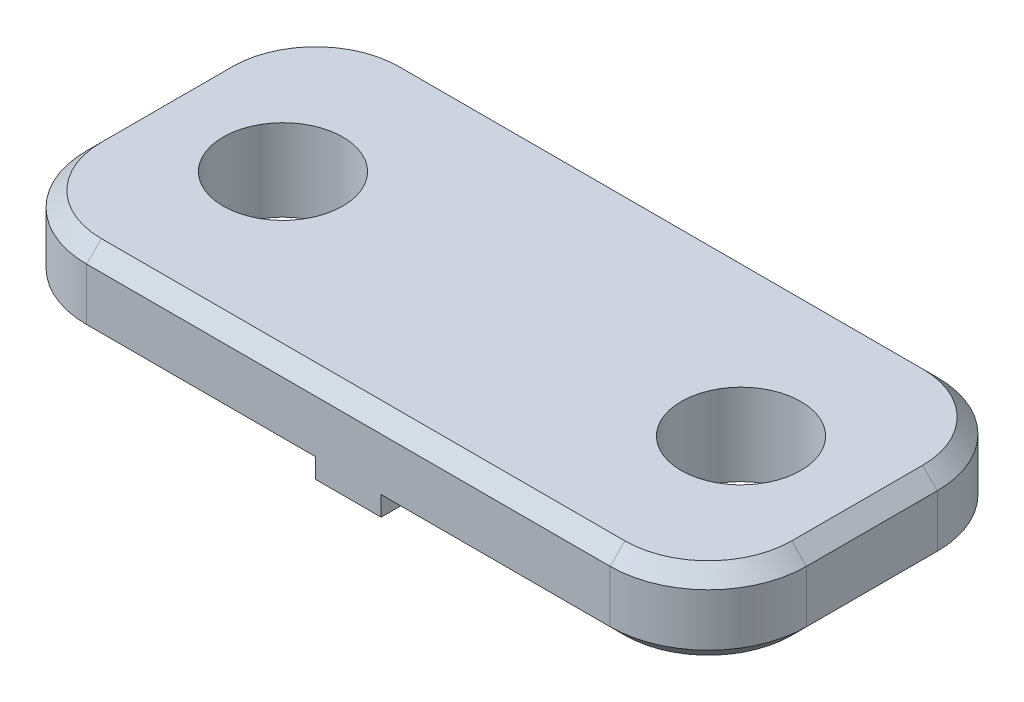
ISO-10303-21;
HEADER;
FILE_DESCRIPTION(('STEP AP214'),'2;1');
FILE_NAME('part.step','',(''),(''),'','','');
FILE_SCHEMA(('AUTOMOTIVE_DESIGN { 1 0 10303 214 1 1 1 1 }'));
ENDSEC;
DATA;
#1=APPLICATION_CONTEXT('core data for automotive mechanical design processes');
#2=APPLICATION_PROTOCOL_DEFINITION('international standard','automotive_design',2000,#1);
#3=PRODUCT_CONTEXT('',#1,'mechanical');
#4=PRODUCT('Part','Part','',(#3));
#5=PRODUCT_RELATED_PRODUCT_CATEGORY('part','',(#4));
#6=PRODUCT_DEFINITION_FORMATION('','',#4);
#7=PRODUCT_DEFINITION_CONTEXT('part definition',#1,'design');
#8=PRODUCT_DEFINITION('design','',#6,#7);
#9=PRODUCT_DEFINITION_SHAPE('','',#8);
#10=(LENGTH_UNIT() NAMED_UNIT(*) SI_UNIT(.MILLI.,.METRE.));
#11=(NAMED_UNIT(*) PLANE_ANGLE_UNIT() SI_UNIT($,.RADIAN.));
#12=(NAMED_UNIT(*) SI_UNIT($,.STERADIAN.) SOLID_ANGLE_UNIT());
#13=UNCERTAINTY_MEASURE_WITH_UNIT(LENGTH_MEASURE(1.E-05),#10,'distance_accuracy_value','');
#14=(GEOMETRIC_REPRESENTATION_CONTEXT(3) GLOBAL_UNCERTAINTY_ASSIGNED_CONTEXT((#13)) GLOBAL_UNIT_ASSIGNED_CONTEXT((#10,
#11,#12)) REPRESENTATION_CONTEXT('',''));
#15=CARTESIAN_POINT('',(0.,0.,0.));
#16=DIRECTION('',(0.,0.,1.));
#17=DIRECTION('',(1.,0.,0.));
#18=AXIS2_PLACEMENT_3D('',#15,#16,#17);
#19=CARTESIAN_POINT('',(0.,0.,0.));
#20=DIRECTION('',(0.,-1.,0.));
#21=DIRECTION('',(0.,0.,-1.));
#22=AXIS2_PLACEMENT_3D('',#19,#20,#21);
#23=PLANE('',#22);
#24=CARTESIAN_POINT('',(8.,0.,2.));
#25=DIRECTION('',(0.,-1.,0.));
#26=DIRECTION('',(0.,0.,-1.));
#27=AXIS2_PLACEMENT_3D('',#24,#25,#26);
#28=CIRCLE('',#27,2.55);
#29=CARTESIAN_POINT('',(10.55,0.,2.));
#30=VERTEX_POINT('',#29);
#31=CARTESIAN_POINT('',(8.,0.,4.55));
#32=VERTEX_POINT('',#31);
#33=EDGE_CURVE('E295',#30,#32,#28,.T.);
#34=ORIENTED_EDGE('',*,*,#33,.T.);
#35=DIRECTION('',(-1.,0.,0.));
#36=VECTOR('',#35,1.);
#37=CARTESIAN_POINT('',(1.,0.,4.55));
#38=LINE('',#37,#36);
#39=CARTESIAN_POINT('',(1.,0.,4.55));
#40=VERTEX_POINT('',#39);
#41=EDGE_CURVE('E298',#32,#40,#38,.T.);
#42=ORIENTED_EDGE('',*,*,#41,.T.);
#43=DIRECTION('',(0.,0.,1.));
#44=VECTOR('',#43,1.);
#45=CARTESIAN_POINT('',(1.,0.,5.));
#46=LINE('',#45,#44);
#47=CARTESIAN_POINT('',(1.,0.,-4.55));
#48=VERTEX_POINT('',#47);
#49=EDGE_CURVE('E408',#48,#40,#46,.T.);
#50=ORIENTED_EDGE('',*,*,#49,.F.);
#51=DIRECTION('',(1.,0.,0.));
#52=VECTOR('',#51,1.);
#53=CARTESIAN_POINT('',(8.,0.,-4.55));
#54=LINE('',#53,#52);
#55=CARTESIAN_POINT('',(8.,0.,-4.55));
#56=VERTEX_POINT('',#55);
#57=EDGE_CURVE('E286',#48,#56,#54,.T.);
#58=ORIENTED_EDGE('',*,*,#57,.T.);
#59=CARTESIAN_POINT('',(8.,0.,-2.));
#60=DIRECTION('',(0.,-1.,0.));
#61=DIRECTION('',(0.,0.,-1.));
#62=AXIS2_PLACEMENT_3D('',#59,#60,#61);
#63=CIRCLE('',#62,2.55);
#64=CARTESIAN_POINT('',(10.55,0.,-2.));
#65=VERTEX_POINT('',#64);
#66=EDGE_CURVE('E289',#56,#65,#63,.T.);
#67=ORIENTED_EDGE('',*,*,#66,.T.);
#68=DIRECTION('',(0.,0.,1.));
#69=VECTOR('',#68,1.);
#70=CARTESIAN_POINT('',(10.55,0.,2.));
#71=LINE('',#70,#69);
#72=EDGE_CURVE('E292',#65,#30,#71,.T.);
#73=ORIENTED_EDGE('',*,*,#72,.T.);
#74=EDGE_LOOP('',(#34,#42,#50,#58,#67,#73));
#75=FACE_BOUND('',#74,.T.);
#76=CARTESIAN_POINT('',(7.,0.,0.));
#77=DIRECTION('',(0.,1.,0.));
#78=DIRECTION('',(0.,0.,1.));
#79=AXIS2_PLACEMENT_3D('',#76,#77,#78);
#80=CIRCLE('',#79,1.8288);
#81=CARTESIAN_POINT('',(7.,0.,1.8288));
#82=VERTEX_POINT('',#81);
#83=EDGE_CURVE('E228',#82,#82,#80,.T.);
#84=ORIENTED_EDGE('',*,*,#83,.T.);
#85=EDGE_LOOP('',(#84));
#86=FACE_BOUND('',#85,.T.);
#87=ADVANCED_FACE('F41',(#75,#86),#23,.T.);
#88=CARTESIAN_POINT('',(11.,2.5,5.));
#89=DIRECTION('',(-1.,0.,0.));
#90=DIRECTION('',(0.,0.,1.));
#91=AXIS2_PLACEMENT_3D('',#88,#89,#90);
#92=PLANE('',#91);
#93=DIRECTION('',(0.,-1.,0.));
#94=VECTOR('',#93,1.);
#95=CARTESIAN_POINT('',(11.,2.5,2.));
#96=LINE('',#95,#94);
#97=CARTESIAN_POINT('',(11.,2.05,2.));
#98=VERTEX_POINT('',#97);
#99=CARTESIAN_POINT('',(11.,0.449999999999996,2.));
#100=VERTEX_POINT('',#99);
#101=EDGE_CURVE('E249',#98,#100,#96,.T.);
#102=ORIENTED_EDGE('',*,*,#101,.T.);
#103=DIRECTION('',(0.,0.,-1.));
#104=VECTOR('',#103,1.);
#105=CARTESIAN_POINT('',(11.,0.449999999999996,-2.));
#106=LINE('',#105,#104);
#107=CARTESIAN_POINT('',(11.,0.449999999999996,-2.));
#108=VERTEX_POINT('',#107);
#109=EDGE_CURVE('E310',#100,#108,#106,.T.);
#110=ORIENTED_EDGE('',*,*,#109,.T.);
#111=DIRECTION('',(0.,-1.,0.));
#112=VECTOR('',#111,1.);
#113=CARTESIAN_POINT('',(11.,2.5,-2.));
#114=LINE('',#113,#112);
#115=CARTESIAN_POINT('',(11.,2.05,-2.));
#116=VERTEX_POINT('',#115);
#117=EDGE_CURVE('E245',#108,#116,#114,.F.);
#118=ORIENTED_EDGE('',*,*,#117,.T.);
#119=DIRECTION('',(0.,0.,1.));
#120=VECTOR('',#119,1.);
#121=CARTESIAN_POINT('',(11.,2.05,5.));
#122=LINE('',#121,#120);
#123=EDGE_CURVE('E307',#116,#98,#122,.T.);
#124=ORIENTED_EDGE('',*,*,#123,.T.);
#125=EDGE_LOOP('',(#102,#110,#118,#124));
#126=FACE_BOUND('',#125,.T.);
#127=ADVANCED_FACE('F479',(#126),#92,.F.);
#128=CARTESIAN_POINT('',(-11.,2.5,-5.));
#129=DIRECTION('',(0.,0.,1.));
#130=DIRECTION('',(1.,0.,0.));
#131=AXIS2_PLACEMENT_3D('',#128,#129,#130);
#132=PLANE('',#131);
#133=DIRECTION('',(0.,-1.,0.));
#134=VECTOR('',#133,1.);
#135=CARTESIAN_POINT('',(8.,2.5,-5.));
#136=LINE('',#135,#134);
#137=CARTESIAN_POINT('',(8.,2.05,-5.));
#138=VERTEX_POINT('',#137);
#139=CARTESIAN_POINT('',(8.,0.449999999999996,-5.));
#140=VERTEX_POINT('',#139);
#141=EDGE_CURVE('E265',#138,#140,#136,.T.);
#142=ORIENTED_EDGE('',*,*,#141,.T.);
#143=DIRECTION('',(-1.,0.,0.));
#144=VECTOR('',#143,1.);
#145=CARTESIAN_POINT('',(1.,0.449999999999996,-5.));
#146=LINE('',#145,#144);
#147=CARTESIAN_POINT('',(1.,0.449999999999996,-5.));
#148=VERTEX_POINT('',#147);
#149=EDGE_CURVE('E325',#140,#148,#146,.T.);
#150=ORIENTED_EDGE('',*,*,#149,.T.);
#151=DIRECTION('',(0.,1.,0.));
#152=VECTOR('',#151,1.);
#153=CARTESIAN_POINT('',(1.,-0.15,-5.));
#154=LINE('',#153,#152);
#155=CARTESIAN_POINT('',(1.,-0.15,-5.));
#156=VERTEX_POINT('',#155);
#157=EDGE_CURVE('E503',#156,#148,#154,.T.);
#158=ORIENTED_EDGE('',*,*,#157,.F.);
#159=DIRECTION('',(1.,0.,0.));
#160=VECTOR('',#159,1.);
#161=CARTESIAN_POINT('',(-1.,-0.15,-5.));
#162=LINE('',#161,#160);
#163=CARTESIAN_POINT('',(-1.,-0.15,-5.));
#164=VERTEX_POINT('',#163);
#165=EDGE_CURVE('E211',#164,#156,#162,.T.);
#166=ORIENTED_EDGE('',*,*,#165,.F.);
#167=DIRECTION('',(0.,1.,0.));
#168=VECTOR('',#167,1.);
#169=CARTESIAN_POINT('',(-1.,-0.15,-5.));
#170=LINE('',#169,#168);
#171=CARTESIAN_POINT('',(-1.,0.45,-5.));
#172=VERTEX_POINT('',#171);
#173=EDGE_CURVE('E230',#164,#172,#170,.T.);
#174=ORIENTED_EDGE('',*,*,#173,.T.);
#175=DIRECTION('',(-1.,0.,0.));
#176=VECTOR('',#175,1.);
#177=CARTESIAN_POINT('',(-8.,0.45,-5.));
#178=LINE('',#177,#176);
#179=CARTESIAN_POINT('',(-8.,0.45,-5.));
#180=VERTEX_POINT('',#179);
#181=EDGE_CURVE('E322',#172,#180,#178,.T.);
#182=ORIENTED_EDGE('',*,*,#181,.T.);
#183=DIRECTION('',(0.,-1.,0.));
#184=VECTOR('',#183,1.);
#185=CARTESIAN_POINT('',(-8.,2.5,-5.));
#186=LINE('',#185,#184);
#187=CARTESIAN_POINT('',(-8.,2.05,-5.));
#188=VERTEX_POINT('',#187);
#189=EDGE_CURVE('E261',#180,#188,#186,.F.);
#190=ORIENTED_EDGE('',*,*,#189,.T.);
#191=DIRECTION('',(1.,0.,0.));
#192=VECTOR('',#191,1.);
#193=CARTESIAN_POINT('',(-11.,2.05,-5.));
#194=LINE('',#193,#192);
#195=EDGE_CURVE('E319',#188,#138,#194,.T.);
#196=ORIENTED_EDGE('',*,*,#195,.T.);
#197=EDGE_LOOP('',(#142,#150,#158,#166,#174,#182,#190,#196));
#198=FACE_BOUND('',#197,.T.);
#199=ADVANCED_FACE('F496',(#198),#132,.F.);
#200=CARTESIAN_POINT('',(-11.,2.5,5.));
#201=DIRECTION('',(1.,0.,0.));
#202=DIRECTION('',(0.,0.,-1.));
#203=AXIS2_PLACEMENT_3D('',#200,#201,#202);
#204=PLANE('',#203);
#205=DIRECTION('',(0.,-1.,0.));
#206=VECTOR('',#205,1.);
#207=CARTESIAN_POINT('',(-11.,2.5,-2.));
#208=LINE('',#207,#206);
#209=CARTESIAN_POINT('',(-11.,2.05,-2.));
#210=VERTEX_POINT('',#209);
#211=CARTESIAN_POINT('',(-11.,0.45,-2.));
#212=VERTEX_POINT('',#211);
#213=EDGE_CURVE('E273',#210,#212,#208,.T.);
#214=ORIENTED_EDGE('',*,*,#213,.T.);
#215=DIRECTION('',(0.,0.,1.));
#216=VECTOR('',#215,1.);
#217=CARTESIAN_POINT('',(-11.,0.45,2.));
#218=LINE('',#217,#216);
#219=CARTESIAN_POINT('',(-11.,0.45,2.));
#220=VERTEX_POINT('',#219);
#221=EDGE_CURVE('E354',#212,#220,#218,.T.);
#222=ORIENTED_EDGE('',*,*,#221,.T.);
#223=DIRECTION('',(0.,-1.,0.));
#224=VECTOR('',#223,1.);
#225=CARTESIAN_POINT('',(-11.,2.5,2.));
#226=LINE('',#225,#224);
#227=CARTESIAN_POINT('',(-11.,2.05,2.));
#228=VERTEX_POINT('',#227);
#229=EDGE_CURVE('E269',#220,#228,#226,.F.);
#230=ORIENTED_EDGE('',*,*,#229,.T.);
#231=DIRECTION('',(0.,0.,-1.));
#232=VECTOR('',#231,1.);
#233=CARTESIAN_POINT('',(-11.,2.05,5.));
#234=LINE('',#233,#232);
#235=EDGE_CURVE('E351',#228,#210,#234,.T.);
#236=ORIENTED_EDGE('',*,*,#235,.T.);
#237=EDGE_LOOP('',(#214,#222,#230,#236));
#238=FACE_BOUND('',#237,.T.);
#239=ADVANCED_FACE('F538',(#238),#204,.F.);
#240=CARTESIAN_POINT('',(-11.,2.5,5.));
#241=DIRECTION('',(0.,0.,-1.));
#242=DIRECTION('',(-1.,0.,0.));
#243=AXIS2_PLACEMENT_3D('',#240,#241,#242);
#244=PLANE('',#243);
#245=DIRECTION('',(0.,1.,0.));
#246=VECTOR('',#245,1.);
#247=CARTESIAN_POINT('',(1.,-0.15,5.));
#248=LINE('',#247,#246);
#249=CARTESIAN_POINT('',(1.,-0.15,5.));
#250=VERTEX_POINT('',#249);
#251=CARTESIAN_POINT('',(1.,0.449999999999996,5.));
#252=VERTEX_POINT('',#251);
#253=EDGE_CURVE('E198',#250,#252,#248,.T.);
#254=ORIENTED_EDGE('',*,*,#253,.T.);
#255=DIRECTION('',(1.,0.,0.));
#256=VECTOR('',#255,1.);
#257=CARTESIAN_POINT('',(8.,0.449999999999996,5.));
#258=LINE('',#257,#256);
#259=CARTESIAN_POINT('',(8.,0.449999999999996,5.));
#260=VERTEX_POINT('',#259);
#261=EDGE_CURVE('E283',#252,#260,#258,.T.);
#262=ORIENTED_EDGE('',*,*,#261,.T.);
#263=DIRECTION('',(0.,-1.,0.));
#264=VECTOR('',#263,1.);
#265=CARTESIAN_POINT('',(8.,2.5,5.));
#266=LINE('',#265,#264);
#267=CARTESIAN_POINT('',(8.,2.05,5.));
#268=VERTEX_POINT('',#267);
#269=EDGE_CURVE('E257',#260,#268,#266,.F.);
#270=ORIENTED_EDGE('',*,*,#269,.T.);
#271=DIRECTION('',(-1.,0.,0.));
#272=VECTOR('',#271,1.);
#273=CARTESIAN_POINT('',(-11.,2.05,5.));
#274=LINE('',#273,#272);
#275=CARTESIAN_POINT('',(-8.,2.05,5.));
#276=VERTEX_POINT('',#275);
#277=EDGE_CURVE('E277',#268,#276,#274,.T.);
#278=ORIENTED_EDGE('',*,*,#277,.T.);
#279=DIRECTION('',(0.,-1.,0.));
#280=VECTOR('',#279,1.);
#281=CARTESIAN_POINT('',(-8.,2.5,5.));
#282=LINE('',#281,#280);
#283=CARTESIAN_POINT('',(-8.,0.45,5.));
#284=VERTEX_POINT('',#283);
#285=EDGE_CURVE('E253',#276,#284,#282,.T.);
#286=ORIENTED_EDGE('',*,*,#285,.T.);
#287=DIRECTION('',(1.,0.,0.));
#288=VECTOR('',#287,1.);
#289=CARTESIAN_POINT('',(-1.,0.45,5.));
#290=LINE('',#289,#288);
#291=CARTESIAN_POINT('',(-1.,0.45,5.));
#292=VERTEX_POINT('',#291);
#293=EDGE_CURVE('E280',#284,#292,#290,.T.);
#294=ORIENTED_EDGE('',*,*,#293,.T.);
#295=DIRECTION('',(0.,1.,0.));
#296=VECTOR('',#295,1.);
#297=CARTESIAN_POINT('',(-1.,-0.15,5.));
#298=LINE('',#297,#296);
#299=CARTESIAN_POINT('',(-1.,-0.15,5.));
#300=VERTEX_POINT('',#299);
#301=EDGE_CURVE('E201',#300,#292,#298,.T.);
#302=ORIENTED_EDGE('',*,*,#301,.F.);
#303=DIRECTION('',(-1.,0.,0.));
#304=VECTOR('',#303,1.);
#305=CARTESIAN_POINT('',(-1.,-0.15,5.));
#306=LINE('',#305,#304);
#307=EDGE_CURVE('E193',#250,#300,#306,.T.);
#308=ORIENTED_EDGE('',*,*,#307,.F.);
#309=EDGE_LOOP('',(#254,#262,#270,#278,#286,#294,#302,#308));
#310=FACE_BOUND('',#309,.T.);
#311=ADVANCED_FACE('F195',(#310),#244,.F.);
#312=CARTESIAN_POINT('',(0.,2.5,0.));
#313=DIRECTION('',(0.,-1.,0.));
#314=DIRECTION('',(0.,0.,-1.));
#315=AXIS2_PLACEMENT_3D('',#312,#313,#314);
#316=PLANE('',#315);
#317=DIRECTION('',(-1.,0.,0.));
#318=VECTOR('',#317,1.);
#319=CARTESIAN_POINT('',(0.,2.5,-4.55));
#320=LINE('',#319,#318);
#321=CARTESIAN_POINT('',(8.,2.5,-4.55));
#322=VERTEX_POINT('',#321);
#323=CARTESIAN_POINT('',(-8.,2.5,-4.55));
#324=VERTEX_POINT('',#323);
#325=EDGE_CURVE('E60',#322,#324,#320,.T.);
#326=ORIENTED_EDGE('',*,*,#325,.T.);
#327=CARTESIAN_POINT('',(-8.,2.5,-2.));
#328=DIRECTION('',(0.,-1.,0.));
#329=DIRECTION('',(0.,0.,-1.));
#330=AXIS2_PLACEMENT_3D('',#327,#328,#329);
#331=CIRCLE('',#330,2.55);
#332=CARTESIAN_POINT('',(-10.55,2.5,-2.));
#333=VERTEX_POINT('',#332);
#334=EDGE_CURVE('E382',#324,#333,#331,.F.);
#335=ORIENTED_EDGE('',*,*,#334,.T.);
#336=DIRECTION('',(0.,0.,1.));
#337=VECTOR('',#336,1.);
#338=CARTESIAN_POINT('',(-10.55,2.5,0.));
#339=LINE('',#338,#337);
#340=CARTESIAN_POINT('',(-10.55,2.5,2.));
#341=VERTEX_POINT('',#340);
#342=EDGE_CURVE('E363',#333,#341,#339,.T.);
#343=ORIENTED_EDGE('',*,*,#342,.T.);
#344=CARTESIAN_POINT('',(-8.,2.5,2.));
#345=DIRECTION('',(0.,-1.,0.));
#346=DIRECTION('',(0.,0.,-1.));
#347=AXIS2_PLACEMENT_3D('',#344,#345,#346);
#348=CIRCLE('',#347,2.55);
#349=CARTESIAN_POINT('',(-8.,2.5,4.55));
#350=VERTEX_POINT('',#349);
#351=EDGE_CURVE('E366',#341,#350,#348,.F.);
#352=ORIENTED_EDGE('',*,*,#351,.T.);
#353=DIRECTION('',(1.,0.,0.));
#354=VECTOR('',#353,1.);
#355=CARTESIAN_POINT('',(0.,2.5,4.55));
#356=LINE('',#355,#354);
#357=CARTESIAN_POINT('',(8.,2.5,4.55));
#358=VERTEX_POINT('',#357);
#359=EDGE_CURVE('E369',#350,#358,#356,.T.);
#360=ORIENTED_EDGE('',*,*,#359,.T.);
#361=CARTESIAN_POINT('',(8.,2.5,2.));
#362=DIRECTION('',(0.,-1.,0.));
#363=DIRECTION('',(0.,0.,-1.));
#364=AXIS2_PLACEMENT_3D('',#361,#362,#363);
#365=CIRCLE('',#364,2.55);
#366=CARTESIAN_POINT('',(10.55,2.5,2.));
#367=VERTEX_POINT('',#366);
#368=EDGE_CURVE('E372',#358,#367,#365,.F.);
#369=ORIENTED_EDGE('',*,*,#368,.T.);
#370=DIRECTION('',(0.,0.,-1.));
#371=VECTOR('',#370,1.);
#372=CARTESIAN_POINT('',(10.55,2.5,0.));
#373=LINE('',#372,#371);
#374=CARTESIAN_POINT('',(10.55,2.5,-2.));
#375=VERTEX_POINT('',#374);
#376=EDGE_CURVE('E375',#367,#375,#373,.T.);
#377=ORIENTED_EDGE('',*,*,#376,.T.);
#378=CARTESIAN_POINT('',(8.,2.5,-2.));
#379=DIRECTION('',(0.,-1.,0.));
#380=DIRECTION('',(0.,0.,-1.));
#381=AXIS2_PLACEMENT_3D('',#378,#379,#380);
#382=CIRCLE('',#381,2.55);
#383=EDGE_CURVE('E65',#375,#322,#382,.F.);
#384=ORIENTED_EDGE('',*,*,#383,.T.);
#385=EDGE_LOOP('',(#326,#335,#343,#352,#360,#369,#377,#384));
#386=FACE_BOUND('',#385,.T.);
#387=CARTESIAN_POINT('',(7.,2.5,0.));
#388=DIRECTION('',(0.,1.,0.));
#389=DIRECTION('',(0.,0.,1.));
#390=AXIS2_PLACEMENT_3D('',#387,#388,#389);
#391=CIRCLE('',#390,1.82879999999999);
#392=CARTESIAN_POINT('',(7.,2.5,1.82879999999999));
#393=VERTEX_POINT('',#392);
#394=EDGE_CURVE('E223',#393,#393,#391,.T.);
#395=ORIENTED_EDGE('',*,*,#394,.F.);
#396=EDGE_LOOP('',(#395));
#397=FACE_BOUND('',#396,.T.);
#398=CARTESIAN_POINT('',(-7.,2.5,0.));
#399=DIRECTION('',(0.,1.,0.));
#400=DIRECTION('',(0.,0.,1.));
#401=AXIS2_PLACEMENT_3D('',#398,#399,#400);
#402=CIRCLE('',#401,1.82879999999999);
#403=CARTESIAN_POINT('',(-7.,2.5,1.82879999999999));
#404=VERTEX_POINT('',#403);
#405=EDGE_CURVE('E237',#404,#404,#402,.T.);
#406=ORIENTED_EDGE('',*,*,#405,.F.);
#407=EDGE_LOOP('',(#406));
#408=FACE_BOUND('',#407,.T.);
#409=ADVANCED_FACE('F576',(#386,#397,#408),#316,.F.);
#410=DIRECTION('',(0.,0.,-1.));
#411=VECTOR('',#410,1.);
#412=CARTESIAN_POINT('',(-1.,0.,5.));
#413=LINE('',#412,#411);
#414=CARTESIAN_POINT('',(-1.,0.,4.55));
#415=VERTEX_POINT('',#414);
#416=CARTESIAN_POINT('',(-1.,0.,-4.55));
#417=VERTEX_POINT('',#416);
#418=EDGE_CURVE('E215',#415,#417,#413,.T.);
#419=ORIENTED_EDGE('',*,*,#418,.F.);
#420=DIRECTION('',(-1.,0.,0.));
#421=VECTOR('',#420,1.);
#422=CARTESIAN_POINT('',(-8.,0.,4.55));
#423=LINE('',#422,#421);
#424=CARTESIAN_POINT('',(-8.,0.,4.55));
#425=VERTEX_POINT('',#424);
#426=EDGE_CURVE('E341',#415,#425,#423,.T.);
#427=ORIENTED_EDGE('',*,*,#426,.T.);
#428=CARTESIAN_POINT('',(-8.,0.,2.));
#429=DIRECTION('',(0.,-1.,0.));
#430=DIRECTION('',(0.,0.,-1.));
#431=AXIS2_PLACEMENT_3D('',#428,#429,#430);
#432=CIRCLE('',#431,2.55);
#433=CARTESIAN_POINT('',(-10.55,0.,2.));
#434=VERTEX_POINT('',#433);
#435=EDGE_CURVE('E329',#425,#434,#432,.T.);
#436=ORIENTED_EDGE('',*,*,#435,.T.);
#437=DIRECTION('',(0.,0.,-1.));
#438=VECTOR('',#437,1.);
#439=CARTESIAN_POINT('',(-10.55,0.,-2.));
#440=LINE('',#439,#438);
#441=CARTESIAN_POINT('',(-10.55,0.,-2.));
#442=VERTEX_POINT('',#441);
#443=EDGE_CURVE('E332',#434,#442,#440,.T.);
#444=ORIENTED_EDGE('',*,*,#443,.T.);
#445=CARTESIAN_POINT('',(-8.,0.,-2.));
#446=DIRECTION('',(0.,-1.,0.));
#447=DIRECTION('',(0.,0.,-1.));
#448=AXIS2_PLACEMENT_3D('',#445,#446,#447);
#449=CIRCLE('',#448,2.55);
#450=CARTESIAN_POINT('',(-8.,0.,-4.55));
#451=VERTEX_POINT('',#450);
#452=EDGE_CURVE('E335',#442,#451,#449,.T.);
#453=ORIENTED_EDGE('',*,*,#452,.T.);
#454=DIRECTION('',(1.,0.,0.));
#455=VECTOR('',#454,1.);
#456=CARTESIAN_POINT('',(-1.,0.,-4.55));
#457=LINE('',#456,#455);
#458=EDGE_CURVE('E338',#451,#417,#457,.T.);
#459=ORIENTED_EDGE('',*,*,#458,.T.);
#460=EDGE_LOOP('',(#419,#427,#436,#444,#453,#459));
#461=FACE_BOUND('',#460,.T.);
#462=CARTESIAN_POINT('',(-7.,0.,0.));
#463=DIRECTION('',(0.,1.,0.));
#464=DIRECTION('',(0.,0.,1.));
#465=AXIS2_PLACEMENT_3D('',#462,#463,#464);
#466=CIRCLE('',#465,1.8288);
#467=CARTESIAN_POINT('',(-7.,0.,1.8288));
#468=VERTEX_POINT('',#467);
#469=EDGE_CURVE('E241',#468,#468,#466,.T.);
#470=ORIENTED_EDGE('',*,*,#469,.T.);
#471=EDGE_LOOP('',(#470));
#472=FACE_BOUND('',#471,.T.);
#473=ADVANCED_FACE('F567',(#461,#472),#23,.T.);
#474=CARTESIAN_POINT('',(-7.,2.5,0.));
#475=DIRECTION('',(0.,1.,0.));
#476=DIRECTION('',(0.,0.,1.));
#477=AXIS2_PLACEMENT_3D('',#474,#475,#476);
#478=CYLINDRICAL_SURFACE('',#477,1.82879999999999);
#479=ORIENTED_EDGE('',*,*,#469,.F.);
#480=EDGE_LOOP('',(#479));
#481=FACE_BOUND('',#480,.T.);
#482=ORIENTED_EDGE('',*,*,#405,.T.);
#483=EDGE_LOOP('',(#482));
#484=FACE_BOUND('',#483,.T.);
#485=ADVANCED_FACE('F575',(#481,#484),#478,.F.);
#486=CARTESIAN_POINT('',(7.,2.5,0.));
#487=DIRECTION('',(0.,1.,0.));
#488=DIRECTION('',(0.,0.,1.));
#489=AXIS2_PLACEMENT_3D('',#486,#487,#488);
#490=CYLINDRICAL_SURFACE('',#489,1.82879999999999);
#491=ORIENTED_EDGE('',*,*,#83,.F.);
#492=EDGE_LOOP('',(#491));
#493=FACE_BOUND('',#492,.T.);
#494=ORIENTED_EDGE('',*,*,#394,.T.);
#495=EDGE_LOOP('',(#494));
#496=FACE_BOUND('',#495,.T.);
#497=ADVANCED_FACE('F582',(#493,#496),#490,.F.);
#498=CARTESIAN_POINT('',(1.,-0.15,5.));
#499=DIRECTION('',(-1.,0.,0.));
#500=DIRECTION('',(0.,0.,1.));
#501=AXIS2_PLACEMENT_3D('',#498,#499,#500);
#502=PLANE('',#501);
#503=ORIENTED_EDGE('',*,*,#157,.T.);
#504=DIRECTION('',(0.,-0.707106781186545,0.70710678118655));
#505=VECTOR('',#504,1.);
#506=CARTESIAN_POINT('',(1.,-4.85,0.300000000000037));
#507=LINE('',#506,#505);
#508=EDGE_CURVE('E387',#148,#48,#507,.T.);
#509=ORIENTED_EDGE('',*,*,#508,.T.);
#510=ORIENTED_EDGE('',*,*,#49,.T.);
#511=DIRECTION('',(0.,0.707106781186545,0.70710678118655));
#512=VECTOR('',#511,1.);
#513=CARTESIAN_POINT('',(1.,0.15,4.7));
#514=LINE('',#513,#512);
#515=EDGE_CURVE('E220',#40,#252,#514,.T.);
#516=ORIENTED_EDGE('',*,*,#515,.T.);
#517=ORIENTED_EDGE('',*,*,#253,.F.);
#518=DIRECTION('',(0.,0.,1.));
#519=VECTOR('',#518,1.);
#520=CARTESIAN_POINT('',(1.,-0.15,5.));
#521=LINE('',#520,#519);
#522=EDGE_CURVE('E206',#156,#250,#521,.T.);
#523=ORIENTED_EDGE('',*,*,#522,.F.);
#524=EDGE_LOOP('',(#503,#509,#510,#516,#517,#523));
#525=FACE_BOUND('',#524,.T.);
#526=ADVANCED_FACE('F217',(#525),#502,.F.);
#527=CARTESIAN_POINT('',(-1.,-0.15,5.));
#528=DIRECTION('',(1.,0.,0.));
#529=DIRECTION('',(0.,0.,-1.));
#530=AXIS2_PLACEMENT_3D('',#527,#528,#529);
#531=PLANE('',#530);
#532=ORIENTED_EDGE('',*,*,#301,.T.);
#533=DIRECTION('',(0.,-0.707106781186549,-0.707106781186547));
#534=VECTOR('',#533,1.);
#535=CARTESIAN_POINT('',(-1.,0.149999999999999,4.7));
#536=LINE('',#535,#534);
#537=EDGE_CURVE('E52',#292,#415,#536,.T.);
#538=ORIENTED_EDGE('',*,*,#537,.T.);
#539=ORIENTED_EDGE('',*,*,#418,.T.);
#540=DIRECTION('',(0.,0.707106781186549,-0.707106781186547));
#541=VECTOR('',#540,1.);
#542=CARTESIAN_POINT('',(-1.,-4.85,0.299999999999986));
#543=LINE('',#542,#541);
#544=EDGE_CURVE('E11',#417,#172,#543,.T.);
#545=ORIENTED_EDGE('',*,*,#544,.T.);
#546=ORIENTED_EDGE('',*,*,#173,.F.);
#547=DIRECTION('',(0.,0.,-1.));
#548=VECTOR('',#547,1.);
#549=CARTESIAN_POINT('',(-1.,-0.15,5.));
#550=LINE('',#549,#548);
#551=EDGE_CURVE('E205',#300,#164,#550,.T.);
#552=ORIENTED_EDGE('',*,*,#551,.F.);
#553=EDGE_LOOP('',(#532,#538,#539,#545,#546,#552));
#554=FACE_BOUND('',#553,.T.);
#555=ADVANCED_FACE('F521',(#554),#531,.F.);
#556=CARTESIAN_POINT('',(0.,-0.15,0.));
#557=DIRECTION('',(0.,-1.,0.));
#558=DIRECTION('',(0.,0.,-1.));
#559=AXIS2_PLACEMENT_3D('',#556,#557,#558);
#560=PLANE('',#559);
#561=ORIENTED_EDGE('',*,*,#522,.T.);
#562=ORIENTED_EDGE('',*,*,#307,.T.);
#563=ORIENTED_EDGE('',*,*,#551,.T.);
#564=ORIENTED_EDGE('',*,*,#165,.T.);
#565=EDGE_LOOP('',(#561,#562,#563,#564));
#566=FACE_BOUND('',#565,.T.);
#567=ADVANCED_FACE('F209',(#566),#560,.T.);
#568=CARTESIAN_POINT('',(8.,2.5,2.));
#569=DIRECTION('',(0.,-1.,0.));
#570=DIRECTION('',(0.,0.,-1.));
#571=AXIS2_PLACEMENT_3D('',#568,#569,#570);
#572=CYLINDRICAL_SURFACE('',#571,3.);
#573=ORIENTED_EDGE('',*,*,#269,.F.);
#574=CARTESIAN_POINT('',(8.,0.449999999999996,2.));
#575=DIRECTION('',(0.,-1.,0.));
#576=DIRECTION('',(0.,0.,-1.));
#577=AXIS2_PLACEMENT_3D('',#574,#575,#576);
#578=CIRCLE('',#577,3.);
#579=EDGE_CURVE('E304',#260,#100,#578,.F.);
#580=ORIENTED_EDGE('',*,*,#579,.T.);
#581=ORIENTED_EDGE('',*,*,#101,.F.);
#582=CARTESIAN_POINT('',(8.,2.05,2.));
#583=DIRECTION('',(0.,-1.,0.));
#584=DIRECTION('',(0.,0.,-1.));
#585=AXIS2_PLACEMENT_3D('',#582,#583,#584);
#586=CIRCLE('',#585,3.);
#587=EDGE_CURVE('E301',#98,#268,#586,.T.);
#588=ORIENTED_EDGE('',*,*,#587,.T.);
#589=EDGE_LOOP('',(#573,#580,#581,#588));
#590=FACE_BOUND('',#589,.T.);
#591=ADVANCED_FACE('F466',(#590),#572,.T.);
#592=CARTESIAN_POINT('',(8.,2.5,-2.));
#593=DIRECTION('',(0.,-1.,0.));
#594=DIRECTION('',(0.,0.,-1.));
#595=AXIS2_PLACEMENT_3D('',#592,#593,#594);
#596=CYLINDRICAL_SURFACE('',#595,3.);
#597=ORIENTED_EDGE('',*,*,#117,.F.);
#598=CARTESIAN_POINT('',(8.,0.449999999999996,-2.));
#599=DIRECTION('',(0.,-1.,0.));
#600=DIRECTION('',(0.,0.,-1.));
#601=AXIS2_PLACEMENT_3D('',#598,#599,#600);
#602=CIRCLE('',#601,3.);
#603=EDGE_CURVE('E316',#108,#140,#602,.F.);
#604=ORIENTED_EDGE('',*,*,#603,.T.);
#605=ORIENTED_EDGE('',*,*,#141,.F.);
#606=CARTESIAN_POINT('',(8.,2.05,-2.));
#607=DIRECTION('',(0.,-1.,0.));
#608=DIRECTION('',(0.,0.,-1.));
#609=AXIS2_PLACEMENT_3D('',#606,#607,#608);
#610=CIRCLE('',#609,3.);
#611=EDGE_CURVE('E313',#138,#116,#610,.T.);
#612=ORIENTED_EDGE('',*,*,#611,.T.);
#613=EDGE_LOOP('',(#597,#604,#605,#612));
#614=FACE_BOUND('',#613,.T.);
#615=ADVANCED_FACE('F492',(#614),#596,.T.);
#616=CARTESIAN_POINT('',(-8.,2.5,-2.));
#617=DIRECTION('',(0.,-1.,0.));
#618=DIRECTION('',(0.,0.,-1.));
#619=AXIS2_PLACEMENT_3D('',#616,#617,#618);
#620=CYLINDRICAL_SURFACE('',#619,3.);
#621=ORIENTED_EDGE('',*,*,#189,.F.);
#622=CARTESIAN_POINT('',(-8.,0.45,-2.));
#623=DIRECTION('',(0.,-1.,0.));
#624=DIRECTION('',(0.,0.,-1.));
#625=AXIS2_PLACEMENT_3D('',#622,#623,#624);
#626=CIRCLE('',#625,3.);
#627=EDGE_CURVE('E348',#180,#212,#626,.F.);
#628=ORIENTED_EDGE('',*,*,#627,.T.);
#629=ORIENTED_EDGE('',*,*,#213,.F.);
#630=CARTESIAN_POINT('',(-8.,2.05,-2.));
#631=DIRECTION('',(0.,-1.,0.));
#632=DIRECTION('',(0.,0.,-1.));
#633=AXIS2_PLACEMENT_3D('',#630,#631,#632);
#634=CIRCLE('',#633,3.);
#635=EDGE_CURVE('E344',#210,#188,#634,.T.);
#636=ORIENTED_EDGE('',*,*,#635,.T.);
#637=EDGE_LOOP('',(#621,#628,#629,#636));
#638=FACE_BOUND('',#637,.T.);
#639=ADVANCED_FACE('F535',(#638),#620,.T.);
#640=CARTESIAN_POINT('',(-8.,2.5,2.));
#641=DIRECTION('',(0.,-1.,0.));
#642=DIRECTION('',(0.,0.,-1.));
#643=AXIS2_PLACEMENT_3D('',#640,#641,#642);
#644=CYLINDRICAL_SURFACE('',#643,3.);
#645=ORIENTED_EDGE('',*,*,#229,.F.);
#646=CARTESIAN_POINT('',(-8.,0.45,2.));
#647=DIRECTION('',(0.,-1.,0.));
#648=DIRECTION('',(0.,0.,-1.));
#649=AXIS2_PLACEMENT_3D('',#646,#647,#648);
#650=CIRCLE('',#649,3.);
#651=EDGE_CURVE('E360',#220,#284,#650,.F.);
#652=ORIENTED_EDGE('',*,*,#651,.T.);
#653=ORIENTED_EDGE('',*,*,#285,.F.);
#654=CARTESIAN_POINT('',(-8.,2.05,2.));
#655=DIRECTION('',(0.,-1.,0.));
#656=DIRECTION('',(0.,0.,-1.));
#657=AXIS2_PLACEMENT_3D('',#654,#655,#656);
#658=CIRCLE('',#657,3.);
#659=EDGE_CURVE('E357',#276,#228,#658,.T.);
#660=ORIENTED_EDGE('',*,*,#659,.T.);
#661=EDGE_LOOP('',(#645,#652,#653,#660));
#662=FACE_BOUND('',#661,.T.);
#663=ADVANCED_FACE('F667',(#662),#644,.T.);
#664=CARTESIAN_POINT('',(-11.,0.449999999999996,-5.));
#665=DIRECTION('',(0.,-0.70710678118655,-0.707106781186545));
#666=DIRECTION('',(1.,0.,0.));
#667=AXIS2_PLACEMENT_3D('',#664,#665,#666);
#668=PLANE('',#667);
#669=ORIENTED_EDGE('',*,*,#508,.F.);
#670=ORIENTED_EDGE('',*,*,#149,.F.);
#671=DIRECTION('',(0.,0.707106781186545,-0.70710678118655));
#672=VECTOR('',#671,1.);
#673=CARTESIAN_POINT('',(8.,0.,-4.55));
#674=LINE('',#673,#672);
#675=EDGE_CURVE('E404',#56,#140,#674,.T.);
#676=ORIENTED_EDGE('',*,*,#675,.F.);
#677=ORIENTED_EDGE('',*,*,#57,.F.);
#678=EDGE_LOOP('',(#669,#670,#676,#677));
#679=FACE_BOUND('',#678,.T.);
#680=ADVANCED_FACE('F500',(#679),#668,.T.);
#681=CARTESIAN_POINT('',(8.,0.,-2.));
#682=DIRECTION('',(0.,1.,0.));
#683=DIRECTION('',(0.,0.,1.));
#684=AXIS2_PLACEMENT_3D('',#681,#682,#683);
#685=CONICAL_SURFACE('',#684,2.55,0.785398163397452);
#686=ORIENTED_EDGE('',*,*,#675,.T.);
#687=ORIENTED_EDGE('',*,*,#603,.F.);
#688=DIRECTION('',(0.707106781186549,0.707106781186546,0.));
#689=VECTOR('',#688,1.);
#690=CARTESIAN_POINT('',(10.55,0.,-2.));
#691=LINE('',#690,#689);
#692=EDGE_CURVE('E400',#65,#108,#691,.T.);
#693=ORIENTED_EDGE('',*,*,#692,.F.);
#694=ORIENTED_EDGE('',*,*,#66,.F.);
#695=EDGE_LOOP('',(#686,#687,#693,#694));
#696=FACE_BOUND('',#695,.T.);
#697=ADVANCED_FACE('F488',(#696),#685,.T.);
#698=CARTESIAN_POINT('',(11.,0.449999999999996,5.));
#699=DIRECTION('',(0.707106781186545,-0.70710678118655,0.));
#700=DIRECTION('',(0.,0.,1.));
#701=AXIS2_PLACEMENT_3D('',#698,#699,#700);
#702=PLANE('',#701);
#703=ORIENTED_EDGE('',*,*,#692,.T.);
#704=ORIENTED_EDGE('',*,*,#109,.F.);
#705=DIRECTION('',(0.70710678118655,0.707106781186545,0.));
#706=VECTOR('',#705,1.);
#707=CARTESIAN_POINT('',(10.55,0.,2.));
#708=LINE('',#707,#706);
#709=EDGE_CURVE('E395',#30,#100,#708,.T.);
#710=ORIENTED_EDGE('',*,*,#709,.F.);
#711=ORIENTED_EDGE('',*,*,#72,.F.);
#712=EDGE_LOOP('',(#703,#704,#710,#711));
#713=FACE_BOUND('',#712,.T.);
#714=ADVANCED_FACE('F482',(#713),#702,.T.);
#715=CARTESIAN_POINT('',(8.,0.,2.));
#716=DIRECTION('',(0.,1.,0.));
#717=DIRECTION('',(0.,0.,1.));
#718=AXIS2_PLACEMENT_3D('',#715,#716,#717);
#719=CONICAL_SURFACE('',#718,2.55,0.785398163397453);
#720=ORIENTED_EDGE('',*,*,#709,.T.);
#721=ORIENTED_EDGE('',*,*,#579,.F.);
#722=DIRECTION('',(0.,0.707106781186544,0.707106781186551));
#723=VECTOR('',#722,1.);
#724=CARTESIAN_POINT('',(8.,0.,4.55));
#725=LINE('',#724,#723);
#726=EDGE_CURVE('E392',#32,#260,#725,.T.);
#727=ORIENTED_EDGE('',*,*,#726,.F.);
#728=ORIENTED_EDGE('',*,*,#33,.F.);
#729=EDGE_LOOP('',(#720,#721,#727,#728));
#730=FACE_BOUND('',#729,.T.);
#731=ADVANCED_FACE('F475',(#730),#719,.T.);
#732=CARTESIAN_POINT('',(-11.,0.449999999999996,5.));
#733=DIRECTION('',(0.,-0.70710678118655,0.707106781186545));
#734=DIRECTION('',(-1.,0.,0.));
#735=AXIS2_PLACEMENT_3D('',#732,#733,#734);
#736=PLANE('',#735);
#737=ORIENTED_EDGE('',*,*,#515,.F.);
#738=ORIENTED_EDGE('',*,*,#41,.F.);
#739=ORIENTED_EDGE('',*,*,#726,.T.);
#740=ORIENTED_EDGE('',*,*,#261,.F.);
#741=EDGE_LOOP('',(#737,#738,#739,#740));
#742=FACE_BOUND('',#741,.T.);
#743=ADVANCED_FACE('F469',(#742),#736,.T.);
#744=CARTESIAN_POINT('',(-11.,0.45,-5.));
#745=DIRECTION('',(0.,-0.707106781186546,-0.707106781186548));
#746=DIRECTION('',(1.,0.,0.));
#747=AXIS2_PLACEMENT_3D('',#744,#745,#746);
#748=PLANE('',#747);
#749=ORIENTED_EDGE('',*,*,#544,.F.);
#750=ORIENTED_EDGE('',*,*,#458,.F.);
#751=DIRECTION('',(0.,-0.707106781186548,0.707106781186546));
#752=VECTOR('',#751,1.);
#753=CARTESIAN_POINT('',(-8.,0.45,-5.));
#754=LINE('',#753,#752);
#755=EDGE_CURVE('E396',#180,#451,#754,.T.);
#756=ORIENTED_EDGE('',*,*,#755,.F.);
#757=ORIENTED_EDGE('',*,*,#181,.F.);
#758=EDGE_LOOP('',(#749,#750,#756,#757));
#759=FACE_BOUND('',#758,.T.);
#760=ADVANCED_FACE('F526',(#759),#748,.T.);
#761=CARTESIAN_POINT('',(-8.,0.,-2.));
#762=DIRECTION('',(0.,1.,0.));
#763=DIRECTION('',(0.,0.,1.));
#764=AXIS2_PLACEMENT_3D('',#761,#762,#763);
#765=CONICAL_SURFACE('',#764,2.55,0.785398163397448);
#766=ORIENTED_EDGE('',*,*,#755,.T.);
#767=ORIENTED_EDGE('',*,*,#452,.F.);
#768=DIRECTION('',(0.707106781186547,-0.707106781186549,0.));
#769=VECTOR('',#768,1.);
#770=CARTESIAN_POINT('',(-11.,0.45,-2.));
#771=LINE('',#770,#769);
#772=EDGE_CURVE('E417',#212,#442,#771,.T.);
#773=ORIENTED_EDGE('',*,*,#772,.F.);
#774=ORIENTED_EDGE('',*,*,#627,.F.);
#775=EDGE_LOOP('',(#766,#767,#773,#774));
#776=FACE_BOUND('',#775,.T.);
#777=ADVANCED_FACE('F531',(#776),#765,.T.);
#778=CARTESIAN_POINT('',(-11.,0.45,5.));
#779=DIRECTION('',(-0.707106781186548,-0.707106781186546,0.));
#780=DIRECTION('',(0.,0.,-1.));
#781=AXIS2_PLACEMENT_3D('',#778,#779,#780);
#782=PLANE('',#781);
#783=ORIENTED_EDGE('',*,*,#772,.T.);
#784=ORIENTED_EDGE('',*,*,#443,.F.);
#785=DIRECTION('',(0.707106781186546,-0.707106781186548,0.));
#786=VECTOR('',#785,1.);
#787=CARTESIAN_POINT('',(-11.,0.45,2.));
#788=LINE('',#787,#786);
#789=EDGE_CURVE('E413',#220,#434,#788,.T.);
#790=ORIENTED_EDGE('',*,*,#789,.F.);
#791=ORIENTED_EDGE('',*,*,#221,.F.);
#792=EDGE_LOOP('',(#783,#784,#790,#791));
#793=FACE_BOUND('',#792,.T.);
#794=ADVANCED_FACE('F603',(#793),#782,.T.);
#795=CARTESIAN_POINT('',(-8.,0.,2.));
#796=DIRECTION('',(0.,1.,0.));
#797=DIRECTION('',(0.,0.,1.));
#798=AXIS2_PLACEMENT_3D('',#795,#796,#797);
#799=CONICAL_SURFACE('',#798,2.55,0.785398163397447);
#800=ORIENTED_EDGE('',*,*,#789,.T.);
#801=ORIENTED_EDGE('',*,*,#435,.F.);
#802=DIRECTION('',(0.,-0.707106781186548,-0.707106781186547));
#803=VECTOR('',#802,1.);
#804=CARTESIAN_POINT('',(-8.,0.45,5.));
#805=LINE('',#804,#803);
#806=EDGE_CURVE('E409',#284,#425,#805,.T.);
#807=ORIENTED_EDGE('',*,*,#806,.F.);
#808=ORIENTED_EDGE('',*,*,#651,.F.);
#809=EDGE_LOOP('',(#800,#801,#807,#808));
#810=FACE_BOUND('',#809,.T.);
#811=ADVANCED_FACE('F599',(#810),#799,.T.);
#812=CARTESIAN_POINT('',(-11.,0.45,5.));
#813=DIRECTION('',(0.,-0.707106781186546,0.707106781186548));
#814=DIRECTION('',(-1.,0.,0.));
#815=AXIS2_PLACEMENT_3D('',#812,#813,#814);
#816=PLANE('',#815);
#817=ORIENTED_EDGE('',*,*,#806,.T.);
#818=ORIENTED_EDGE('',*,*,#426,.F.);
#819=ORIENTED_EDGE('',*,*,#537,.F.);
#820=ORIENTED_EDGE('',*,*,#293,.F.);
#821=EDGE_LOOP('',(#817,#818,#819,#820));
#822=FACE_BOUND('',#821,.T.);
#823=ADVANCED_FACE('F594',(#822),#816,.T.);
#824=CARTESIAN_POINT('',(8.,2.5,2.));
#825=DIRECTION('',(0.,-1.,0.));
#826=DIRECTION('',(0.,0.,-1.));
#827=AXIS2_PLACEMENT_3D('',#824,#825,#826);
#828=CONICAL_SURFACE('',#827,2.55,0.785398163397449);
#829=DIRECTION('',(0.,0.707106781186547,-0.707106781186548));
#830=VECTOR('',#829,1.);
#831=CARTESIAN_POINT('',(8.,2.05,5.));
#832=LINE('',#831,#830);
#833=EDGE_CURVE('E445',#268,#358,#832,.T.);
#834=ORIENTED_EDGE('',*,*,#833,.F.);
#835=ORIENTED_EDGE('',*,*,#587,.F.);
#836=DIRECTION('',(0.707106781186547,-0.707106781186547,0.));
#837=VECTOR('',#836,1.);
#838=CARTESIAN_POINT('',(10.55,2.5,2.));
#839=LINE('',#838,#837);
#840=EDGE_CURVE('E46',#367,#98,#839,.T.);
#841=ORIENTED_EDGE('',*,*,#840,.F.);
#842=ORIENTED_EDGE('',*,*,#368,.F.);
#843=EDGE_LOOP('',(#834,#835,#841,#842));
#844=FACE_BOUND('',#843,.T.);
#845=ADVANCED_FACE('F44',(#844),#828,.T.);
#846=CARTESIAN_POINT('',(10.55,2.5,0.));
#847=DIRECTION('',(-0.707106781186547,-0.707106781186547,0.));
#848=DIRECTION('',(0.,0.,-1.));
#849=AXIS2_PLACEMENT_3D('',#846,#847,#848);
#850=PLANE('',#849);
#851=ORIENTED_EDGE('',*,*,#840,.T.);
#852=ORIENTED_EDGE('',*,*,#123,.F.);
#853=DIRECTION('',(0.707106781186547,-0.707106781186547,0.));
#854=VECTOR('',#853,1.);
#855=CARTESIAN_POINT('',(10.55,2.5,-2.));
#856=LINE('',#855,#854);
#857=EDGE_CURVE('E442',#375,#116,#856,.T.);
#858=ORIENTED_EDGE('',*,*,#857,.F.);
#859=ORIENTED_EDGE('',*,*,#376,.F.);
#860=EDGE_LOOP('',(#851,#852,#858,#859));
#861=FACE_BOUND('',#860,.T.);
#862=ADVANCED_FACE('F458',(#861),#850,.F.);
#863=CARTESIAN_POINT('',(0.,2.5,4.55));
#864=DIRECTION('',(0.,-0.707106781186547,-0.707106781186547));
#865=DIRECTION('',(1.,0.,0.));
#866=AXIS2_PLACEMENT_3D('',#863,#864,#865);
#867=PLANE('',#866);
#868=ORIENTED_EDGE('',*,*,#833,.T.);
#869=ORIENTED_EDGE('',*,*,#359,.F.);
#870=DIRECTION('',(0.,0.707106781186547,-0.707106781186547));
#871=VECTOR('',#870,1.);
#872=CARTESIAN_POINT('',(-8.,2.05,5.));
#873=LINE('',#872,#871);
#874=EDGE_CURVE('E438',#276,#350,#873,.T.);
#875=ORIENTED_EDGE('',*,*,#874,.F.);
#876=ORIENTED_EDGE('',*,*,#277,.F.);
#877=EDGE_LOOP('',(#868,#869,#875,#876));
#878=FACE_BOUND('',#877,.T.);
#879=ADVANCED_FACE('F555',(#878),#867,.F.);
#880=CARTESIAN_POINT('',(8.,2.5,-2.));
#881=DIRECTION('',(0.,-1.,0.));
#882=DIRECTION('',(0.,0.,-1.));
#883=AXIS2_PLACEMENT_3D('',#880,#881,#882);
#884=CONICAL_SURFACE('',#883,2.55,0.785398163397448);
#885=ORIENTED_EDGE('',*,*,#857,.T.);
#886=ORIENTED_EDGE('',*,*,#611,.F.);
#887=DIRECTION('',(0.,-0.707106781186547,-0.707106781186547));
#888=VECTOR('',#887,1.);
#889=CARTESIAN_POINT('',(8.,2.5,-4.55));
#890=LINE('',#889,#888);
#891=EDGE_CURVE('E434',#322,#138,#890,.T.);
#892=ORIENTED_EDGE('',*,*,#891,.F.);
#893=ORIENTED_EDGE('',*,*,#383,.F.);
#894=EDGE_LOOP('',(#885,#886,#892,#893));
#895=FACE_BOUND('',#894,.T.);
#896=ADVANCED_FACE('F552',(#895),#884,.T.);
#897=CARTESIAN_POINT('',(-8.,2.5,2.));
#898=DIRECTION('',(0.,-1.,0.));
#899=DIRECTION('',(0.,0.,-1.));
#900=AXIS2_PLACEMENT_3D('',#897,#898,#899);
#901=CONICAL_SURFACE('',#900,2.55,0.785398163397448);
#902=ORIENTED_EDGE('',*,*,#874,.T.);
#903=ORIENTED_EDGE('',*,*,#351,.F.);
#904=DIRECTION('',(0.707106781186547,0.707106781186547,0.));
#905=VECTOR('',#904,1.);
#906=CARTESIAN_POINT('',(-11.,2.05,2.));
#907=LINE('',#906,#905);
#908=EDGE_CURVE('E430',#228,#341,#907,.T.);
#909=ORIENTED_EDGE('',*,*,#908,.F.);
#910=ORIENTED_EDGE('',*,*,#659,.F.);
#911=EDGE_LOOP('',(#902,#903,#909,#910));
#912=FACE_BOUND('',#911,.T.);
#913=ADVANCED_FACE('F554',(#912),#901,.T.);
#914=CARTESIAN_POINT('',(0.,2.5,-4.55));
#915=DIRECTION('',(0.,-0.707106781186547,0.707106781186547));
#916=DIRECTION('',(-1.,0.,0.));
#917=AXIS2_PLACEMENT_3D('',#914,#915,#916);
#918=PLANE('',#917);
#919=ORIENTED_EDGE('',*,*,#891,.T.);
#920=ORIENTED_EDGE('',*,*,#195,.F.);
#921=DIRECTION('',(0.,-0.707106781186547,-0.707106781186547));
#922=VECTOR('',#921,1.);
#923=CARTESIAN_POINT('',(-8.,2.5,-4.55));
#924=LINE('',#923,#922);
#925=EDGE_CURVE('E427',#324,#188,#924,.T.);
#926=ORIENTED_EDGE('',*,*,#925,.F.);
#927=ORIENTED_EDGE('',*,*,#325,.F.);
#928=EDGE_LOOP('',(#919,#920,#926,#927));
#929=FACE_BOUND('',#928,.T.);
#930=ADVANCED_FACE('F550',(#929),#918,.F.);
#931=CARTESIAN_POINT('',(-10.55,2.5,0.));
#932=DIRECTION('',(0.707106781186547,-0.707106781186547,0.));
#933=DIRECTION('',(0.,0.,1.));
#934=AXIS2_PLACEMENT_3D('',#931,#932,#933);
#935=PLANE('',#934);
#936=ORIENTED_EDGE('',*,*,#908,.T.);
#937=ORIENTED_EDGE('',*,*,#342,.F.);
#938=DIRECTION('',(0.707106781186547,0.707106781186547,0.));
#939=VECTOR('',#938,1.);
#940=CARTESIAN_POINT('',(-11.,2.05,-2.));
#941=LINE('',#940,#939);
#942=EDGE_CURVE('E424',#210,#333,#941,.T.);
#943=ORIENTED_EDGE('',*,*,#942,.F.);
#944=ORIENTED_EDGE('',*,*,#235,.F.);
#945=EDGE_LOOP('',(#936,#937,#943,#944));
#946=FACE_BOUND('',#945,.T.);
#947=ADVANCED_FACE('F544',(#946),#935,.F.);
#948=CARTESIAN_POINT('',(-8.,2.5,-2.));
#949=DIRECTION('',(0.,-1.,0.));
#950=DIRECTION('',(0.,0.,-1.));
#951=AXIS2_PLACEMENT_3D('',#948,#949,#950);
#952=CONICAL_SURFACE('',#951,2.55,0.785398163397449);
#953=ORIENTED_EDGE('',*,*,#925,.T.);
#954=ORIENTED_EDGE('',*,*,#635,.F.);
#955=ORIENTED_EDGE('',*,*,#942,.T.);
#956=ORIENTED_EDGE('',*,*,#334,.F.);
#957=EDGE_LOOP('',(#953,#954,#955,#956));
#958=FACE_BOUND('',#957,.T.);
#959=ADVANCED_FACE('F548',(#958),#952,.T.);
#960=CLOSED_SHELL('',(#87,#127,#199,#239,#311,#409,#473,#485,#497,#526,#555,#567,#591,#615,#639,
#663,#680,#697,#714,#731,#743,#760,#777,#794,#811,#823,#845,#862,#879,#896,#913,#930,#947,#959));
#961=MANIFOLD_SOLID_BREP('B2',#960);
#962=ADVANCED_BREP_SHAPE_REPRESENTATION('',(#18,#961),#14);
#963=SHAPE_DEFINITION_REPRESENTATION(#9,#962);
ENDSEC;
END-ISO-10303-21;
